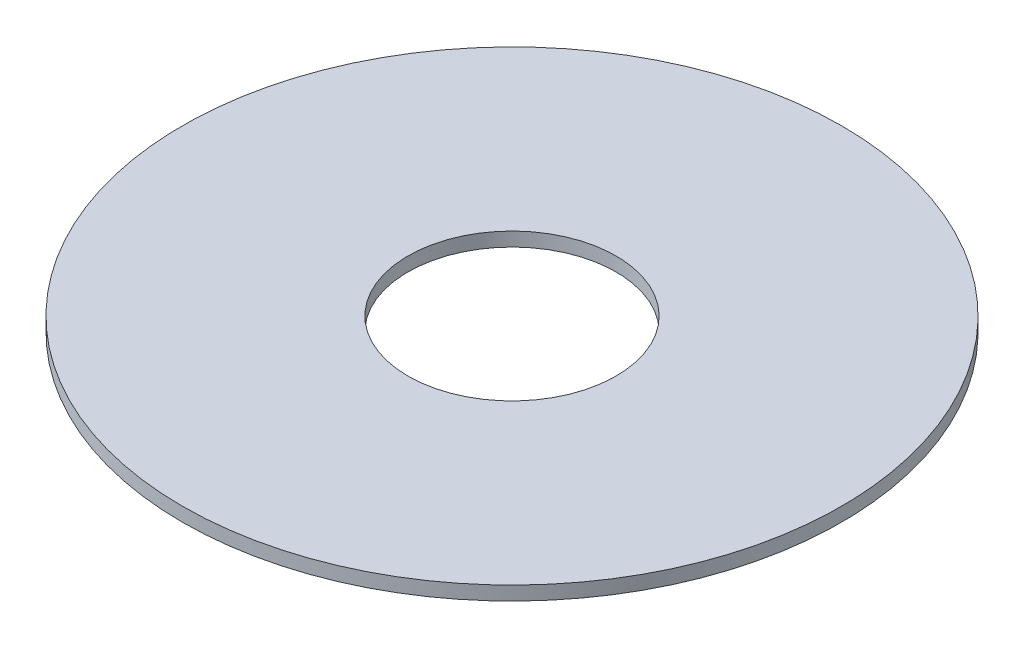
ISO-10303-21;
HEADER;
FILE_DESCRIPTION(('STEP AP214'),'2;1');
FILE_NAME('part.step','',(''),(''),'','','');
FILE_SCHEMA(('AUTOMOTIVE_DESIGN { 1 0 10303 214 1 1 1 1 }'));
ENDSEC;
DATA;
#1=APPLICATION_CONTEXT('core data for automotive mechanical design processes');
#2=APPLICATION_PROTOCOL_DEFINITION('international standard','automotive_design',2000,#1);
#3=PRODUCT_CONTEXT('',#1,'mechanical');
#4=PRODUCT('Part','Part','',(#3));
#5=PRODUCT_RELATED_PRODUCT_CATEGORY('part','',(#4));
#6=PRODUCT_DEFINITION_FORMATION('','',#4);
#7=PRODUCT_DEFINITION_CONTEXT('part definition',#1,'design');
#8=PRODUCT_DEFINITION('design','',#6,#7);
#9=PRODUCT_DEFINITION_SHAPE('','',#8);
#10=(LENGTH_UNIT() NAMED_UNIT(*) SI_UNIT(.MILLI.,.METRE.));
#11=(NAMED_UNIT(*) PLANE_ANGLE_UNIT() SI_UNIT($,.RADIAN.));
#12=(NAMED_UNIT(*) SI_UNIT($,.STERADIAN.) SOLID_ANGLE_UNIT());
#13=UNCERTAINTY_MEASURE_WITH_UNIT(LENGTH_MEASURE(1.E-05),#10,'distance_accuracy_value','');
#14=(GEOMETRIC_REPRESENTATION_CONTEXT(3) GLOBAL_UNCERTAINTY_ASSIGNED_CONTEXT((#13)) GLOBAL_UNIT_ASSIGNED_CONTEXT((#10,
#11,#12)) REPRESENTATION_CONTEXT('',''));
#15=CARTESIAN_POINT('',(0.,0.,0.));
#16=DIRECTION('',(0.,0.,1.));
#17=DIRECTION('',(1.,0.,0.));
#18=AXIS2_PLACEMENT_3D('',#15,#16,#17);
#19=CARTESIAN_POINT('',(0.,4.,0.));
#20=DIRECTION('',(0.,-1.,0.));
#21=DIRECTION('',(0.,0.,-1.));
#22=AXIS2_PLACEMENT_3D('',#19,#20,#21);
#23=CYLINDRICAL_SURFACE('',#22,95.);
#24=CARTESIAN_POINT('',(0.,4.,0.));
#25=DIRECTION('',(0.,1.,0.));
#26=DIRECTION('',(0.,0.,1.));
#27=AXIS2_PLACEMENT_3D('',#24,#25,#26);
#28=CIRCLE('',#27,95.);
#29=CARTESIAN_POINT('',(0.,4.,95.));
#30=VERTEX_POINT('',#29);
#31=EDGE_CURVE('E10',#30,#30,#28,.T.);
#32=ORIENTED_EDGE('',*,*,#31,.F.);
#33=EDGE_LOOP('',(#32));
#34=FACE_BOUND('',#33,.T.);
#35=CARTESIAN_POINT('',(0.,0.,0.));
#36=DIRECTION('',(0.,1.,0.));
#37=DIRECTION('',(0.,0.,1.));
#38=AXIS2_PLACEMENT_3D('',#35,#36,#37);
#39=CIRCLE('',#38,95.);
#40=CARTESIAN_POINT('',(0.,0.,95.));
#41=VERTEX_POINT('',#40);
#42=EDGE_CURVE('E37',#41,#41,#39,.T.);
#43=ORIENTED_EDGE('',*,*,#42,.T.);
#44=EDGE_LOOP('',(#43));
#45=FACE_BOUND('',#44,.T.);
#46=ADVANCED_FACE('F40',(#34,#45),#23,.T.);
#47=CARTESIAN_POINT('',(0.,4.,0.));
#48=DIRECTION('',(0.,1.,0.));
#49=DIRECTION('',(0.,0.,1.));
#50=AXIS2_PLACEMENT_3D('',#47,#48,#49);
#51=PLANE('',#50);
#52=CARTESIAN_POINT('',(0.,4.,0.));
#53=DIRECTION('',(0.,1.,0.));
#54=DIRECTION('',(0.,0.,1.));
#55=AXIS2_PLACEMENT_3D('',#52,#53,#54);
#56=CIRCLE('',#55,30.);
#57=CARTESIAN_POINT('',(0.,4.,30.));
#58=VERTEX_POINT('',#57);
#59=EDGE_CURVE('E50',#58,#58,#56,.T.);
#60=ORIENTED_EDGE('',*,*,#59,.F.);
#61=EDGE_LOOP('',(#60));
#62=FACE_BOUND('',#61,.T.);
#63=ORIENTED_EDGE('',*,*,#31,.T.);
#64=EDGE_LOOP('',(#63));
#65=FACE_BOUND('',#64,.T.);
#66=ADVANCED_FACE('F59',(#62,#65),#51,.T.);
#67=CARTESIAN_POINT('',(0.,0.,0.));
#68=DIRECTION('',(0.,1.,0.));
#69=DIRECTION('',(0.,0.,1.));
#70=AXIS2_PLACEMENT_3D('',#67,#68,#69);
#71=PLANE('',#70);
#72=CARTESIAN_POINT('',(0.,0.,0.));
#73=DIRECTION('',(0.,1.,0.));
#74=DIRECTION('',(0.,0.,1.));
#75=AXIS2_PLACEMENT_3D('',#72,#73,#74);
#76=CIRCLE('',#75,30.);
#77=CARTESIAN_POINT('',(0.,0.,30.));
#78=VERTEX_POINT('',#77);
#79=EDGE_CURVE('E47',#78,#78,#76,.T.);
#80=ORIENTED_EDGE('',*,*,#79,.T.);
#81=EDGE_LOOP('',(#80));
#82=FACE_BOUND('',#81,.T.);
#83=ORIENTED_EDGE('',*,*,#42,.F.);
#84=EDGE_LOOP('',(#83));
#85=FACE_BOUND('',#84,.T.);
#86=ADVANCED_FACE('F58',(#82,#85),#71,.F.);
#87=CARTESIAN_POINT('',(0.,4.,0.));
#88=DIRECTION('',(0.,-1.,0.));
#89=DIRECTION('',(0.,0.,-1.));
#90=AXIS2_PLACEMENT_3D('',#87,#88,#89);
#91=CYLINDRICAL_SURFACE('',#90,30.);
#92=ORIENTED_EDGE('',*,*,#59,.T.);
#93=EDGE_LOOP('',(#92));
#94=FACE_BOUND('',#93,.T.);
#95=ORIENTED_EDGE('',*,*,#79,.F.);
#96=EDGE_LOOP('',(#95));
#97=FACE_BOUND('',#96,.T.);
#98=ADVANCED_FACE('F54',(#94,#97),#91,.F.);
#99=CLOSED_SHELL('',(#46,#66,#86,#98));
#100=MANIFOLD_SOLID_BREP('B2',#99);
#101=ADVANCED_BREP_SHAPE_REPRESENTATION('',(#18,#100),#14);
#102=SHAPE_DEFINITION_REPRESENTATION(#9,#101);
ENDSEC;
END-ISO-10303-21;
